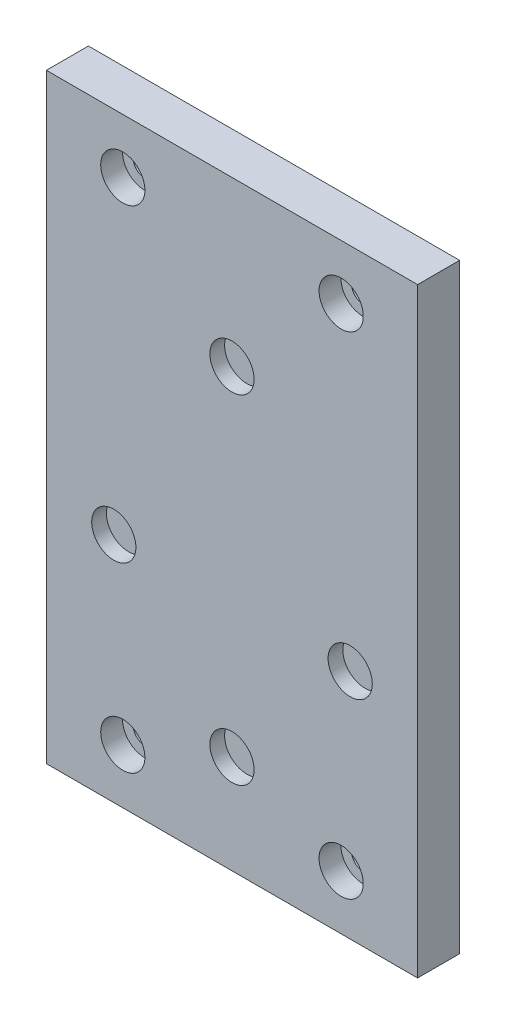
ISO-10303-21;
HEADER;
FILE_DESCRIPTION(('STEP AP214'),'2;1');
FILE_NAME('part.step','',(''),(''),'','','');
FILE_SCHEMA(('AUTOMOTIVE_DESIGN { 1 0 10303 214 1 1 1 1 }'));
ENDSEC;
DATA;
#1=APPLICATION_CONTEXT('core data for automotive mechanical design processes');
#2=APPLICATION_PROTOCOL_DEFINITION('international standard','automotive_design',2000,#1);
#3=PRODUCT_CONTEXT('',#1,'mechanical');
#4=PRODUCT('Part','Part','',(#3));
#5=PRODUCT_RELATED_PRODUCT_CATEGORY('part','',(#4));
#6=PRODUCT_DEFINITION_FORMATION('','',#4);
#7=PRODUCT_DEFINITION_CONTEXT('part definition',#1,'design');
#8=PRODUCT_DEFINITION('design','',#6,#7);
#9=PRODUCT_DEFINITION_SHAPE('','',#8);
#10=(LENGTH_UNIT() NAMED_UNIT(*) SI_UNIT(.MILLI.,.METRE.));
#11=(NAMED_UNIT(*) PLANE_ANGLE_UNIT() SI_UNIT($,.RADIAN.));
#12=(NAMED_UNIT(*) SI_UNIT($,.STERADIAN.) SOLID_ANGLE_UNIT());
#13=UNCERTAINTY_MEASURE_WITH_UNIT(LENGTH_MEASURE(1.E-05),#10,'distance_accuracy_value','');
#14=(GEOMETRIC_REPRESENTATION_CONTEXT(3) GLOBAL_UNCERTAINTY_ASSIGNED_CONTEXT((#13)) GLOBAL_UNIT_ASSIGNED_CONTEXT((#10,
#11,#12)) REPRESENTATION_CONTEXT('',''));
#15=CARTESIAN_POINT('',(0.,0.,0.));
#16=DIRECTION('',(0.,0.,1.));
#17=DIRECTION('',(1.,0.,0.));
#18=AXIS2_PLACEMENT_3D('',#15,#16,#17);
#19=CARTESIAN_POINT('',(0.,-36.95,7.7));
#20=DIRECTION('',(0.,0.,-1.));
#21=DIRECTION('',(-1.,0.,0.));
#22=AXIS2_PLACEMENT_3D('',#19,#20,#21);
#23=CYLINDRICAL_SURFACE('',#22,4.05);
#24=CARTESIAN_POINT('',(0.,-36.95,7.7));
#25=DIRECTION('',(0.,0.,1.));
#26=DIRECTION('',(1.,0.,0.));
#27=AXIS2_PLACEMENT_3D('',#24,#25,#26);
#28=CIRCLE('',#27,4.05);
#29=CARTESIAN_POINT('',(4.05,-36.95,7.7));
#30=VERTEX_POINT('',#29);
#31=EDGE_CURVE('E113',#30,#30,#28,.T.);
#32=ORIENTED_EDGE('',*,*,#31,.T.);
#33=EDGE_LOOP('',(#32));
#34=FACE_BOUND('',#33,.T.);
#35=CARTESIAN_POINT('',(0.,-36.95,5.));
#36=DIRECTION('',(0.,0.,-1.));
#37=DIRECTION('',(-1.,0.,0.));
#38=AXIS2_PLACEMENT_3D('',#35,#36,#37);
#39=CIRCLE('',#38,4.05);
#40=CARTESIAN_POINT('',(-4.05,-36.95,5.));
#41=VERTEX_POINT('',#40);
#42=EDGE_CURVE('E120',#41,#41,#39,.T.);
#43=ORIENTED_EDGE('',*,*,#42,.T.);
#44=EDGE_LOOP('',(#43));
#45=FACE_BOUND('',#44,.T.);
#46=ADVANCED_FACE('F33',(#34,#45),#23,.F.);
#47=CARTESIAN_POINT('',(-21.650635094611,-12.5,7.7));
#48=DIRECTION('',(0.,0.,-1.));
#49=DIRECTION('',(-1.,0.,0.));
#50=AXIS2_PLACEMENT_3D('',#47,#48,#49);
#51=CYLINDRICAL_SURFACE('',#50,4.05);
#52=CARTESIAN_POINT('',(-21.650635094611,-12.5,7.7));
#53=DIRECTION('',(0.,0.,1.));
#54=DIRECTION('',(1.,0.,0.));
#55=AXIS2_PLACEMENT_3D('',#52,#53,#54);
#56=CIRCLE('',#55,4.05);
#57=CARTESIAN_POINT('',(-17.600635094611,-12.5,7.7));
#58=VERTEX_POINT('',#57);
#59=EDGE_CURVE('E165',#58,#58,#56,.T.);
#60=ORIENTED_EDGE('',*,*,#59,.T.);
#61=EDGE_LOOP('',(#60));
#62=FACE_BOUND('',#61,.T.);
#63=CARTESIAN_POINT('',(-21.650635094611,-12.5,5.));
#64=DIRECTION('',(0.,0.,-1.));
#65=DIRECTION('',(-1.,0.,0.));
#66=AXIS2_PLACEMENT_3D('',#63,#64,#65);
#67=CIRCLE('',#66,4.05);
#68=CARTESIAN_POINT('',(-25.700635094611,-12.5,5.));
#69=VERTEX_POINT('',#68);
#70=EDGE_CURVE('E117',#69,#69,#67,.T.);
#71=ORIENTED_EDGE('',*,*,#70,.T.);
#72=EDGE_LOOP('',(#71));
#73=FACE_BOUND('',#72,.T.);
#74=ADVANCED_FACE('F212',(#62,#73),#51,.F.);
#75=CARTESIAN_POINT('',(0.,25.,7.7));
#76=DIRECTION('',(0.,0.,-1.));
#77=DIRECTION('',(-1.,0.,0.));
#78=AXIS2_PLACEMENT_3D('',#75,#76,#77);
#79=CYLINDRICAL_SURFACE('',#78,4.05);
#80=CARTESIAN_POINT('',(0.,25.,7.7));
#81=DIRECTION('',(0.,0.,1.));
#82=DIRECTION('',(1.,0.,0.));
#83=AXIS2_PLACEMENT_3D('',#80,#81,#82);
#84=CIRCLE('',#83,4.05);
#85=CARTESIAN_POINT('',(4.04999999999999,25.,7.7));
#86=VERTEX_POINT('',#85);
#87=EDGE_CURVE('E162',#86,#86,#84,.T.);
#88=ORIENTED_EDGE('',*,*,#87,.T.);
#89=EDGE_LOOP('',(#88));
#90=FACE_BOUND('',#89,.T.);
#91=CARTESIAN_POINT('',(0.,25.,5.));
#92=DIRECTION('',(0.,0.,-1.));
#93=DIRECTION('',(-1.,0.,0.));
#94=AXIS2_PLACEMENT_3D('',#91,#92,#93);
#95=CIRCLE('',#94,4.05);
#96=CARTESIAN_POINT('',(-4.05000000000001,25.,5.));
#97=VERTEX_POINT('',#96);
#98=EDGE_CURVE('E114',#97,#97,#95,.T.);
#99=ORIENTED_EDGE('',*,*,#98,.T.);
#100=EDGE_LOOP('',(#99));
#101=FACE_BOUND('',#100,.T.);
#102=ADVANCED_FACE('F218',(#90,#101),#79,.F.);
#103=CARTESIAN_POINT('',(21.650635094611,-12.5,7.7));
#104=DIRECTION('',(0.,0.,-1.));
#105=DIRECTION('',(-1.,0.,0.));
#106=AXIS2_PLACEMENT_3D('',#103,#104,#105);
#107=CYLINDRICAL_SURFACE('',#106,4.05);
#108=CARTESIAN_POINT('',(21.650635094611,-12.5,7.7));
#109=DIRECTION('',(0.,0.,1.));
#110=DIRECTION('',(1.,0.,0.));
#111=AXIS2_PLACEMENT_3D('',#108,#109,#110);
#112=CIRCLE('',#111,4.05);
#113=CARTESIAN_POINT('',(25.700635094611,-12.5,7.7));
#114=VERTEX_POINT('',#113);
#115=EDGE_CURVE('E159',#114,#114,#112,.T.);
#116=ORIENTED_EDGE('',*,*,#115,.T.);
#117=EDGE_LOOP('',(#116));
#118=FACE_BOUND('',#117,.T.);
#119=CARTESIAN_POINT('',(21.650635094611,-12.5,5.));
#120=DIRECTION('',(0.,0.,-1.));
#121=DIRECTION('',(-1.,0.,0.));
#122=AXIS2_PLACEMENT_3D('',#119,#120,#121);
#123=CIRCLE('',#122,4.05);
#124=CARTESIAN_POINT('',(17.600635094611,-12.5,5.));
#125=VERTEX_POINT('',#124);
#126=EDGE_CURVE('E110',#125,#125,#123,.T.);
#127=ORIENTED_EDGE('',*,*,#126,.T.);
#128=EDGE_LOOP('',(#127));
#129=FACE_BOUND('',#128,.T.);
#130=ADVANCED_FACE('F228',(#118,#129),#107,.F.);
#131=CARTESIAN_POINT('',(0.,0.,7.7));
#132=DIRECTION('',(0.,0.,1.));
#133=DIRECTION('',(1.,0.,0.));
#134=AXIS2_PLACEMENT_3D('',#131,#132,#133);
#135=PLANE('',#134);
#136=CARTESIAN_POINT('',(-20.,45.,7.7));
#137=DIRECTION('',(0.,0.,-1.));
#138=DIRECTION('',(-1.,0.,0.));
#139=AXIS2_PLACEMENT_3D('',#136,#137,#138);
#140=CIRCLE('',#139,4.05);
#141=CARTESIAN_POINT('',(-24.05,45.,7.7));
#142=VERTEX_POINT('',#141);
#143=EDGE_CURVE('E183',#142,#142,#140,.T.);
#144=ORIENTED_EDGE('',*,*,#143,.T.);
#145=EDGE_LOOP('',(#144));
#146=FACE_BOUND('',#145,.T.);
#147=CARTESIAN_POINT('',(20.,-45.,7.7));
#148=DIRECTION('',(0.,0.,-1.));
#149=DIRECTION('',(-1.,0.,0.));
#150=AXIS2_PLACEMENT_3D('',#147,#148,#149);
#151=CIRCLE('',#150,4.05);
#152=CARTESIAN_POINT('',(15.95,-45.,7.7));
#153=VERTEX_POINT('',#152);
#154=EDGE_CURVE('E176',#153,#153,#151,.T.);
#155=ORIENTED_EDGE('',*,*,#154,.T.);
#156=EDGE_LOOP('',(#155));
#157=FACE_BOUND('',#156,.T.);
#158=CARTESIAN_POINT('',(-20.,-45.,7.7));
#159=DIRECTION('',(0.,0.,-1.));
#160=DIRECTION('',(-1.,0.,0.));
#161=AXIS2_PLACEMENT_3D('',#158,#159,#160);
#162=CIRCLE('',#161,4.05);
#163=CARTESIAN_POINT('',(-24.05,-45.,7.7));
#164=VERTEX_POINT('',#163);
#165=EDGE_CURVE('E188',#164,#164,#162,.T.);
#166=ORIENTED_EDGE('',*,*,#165,.T.);
#167=EDGE_LOOP('',(#166));
#168=FACE_BOUND('',#167,.T.);
#169=CARTESIAN_POINT('',(20.,45.,7.7));
#170=DIRECTION('',(0.,0.,-1.));
#171=DIRECTION('',(-1.,0.,0.));
#172=AXIS2_PLACEMENT_3D('',#169,#170,#171);
#173=CIRCLE('',#172,4.05);
#174=CARTESIAN_POINT('',(15.95,45.,7.7));
#175=VERTEX_POINT('',#174);
#176=EDGE_CURVE('E170',#175,#175,#173,.T.);
#177=ORIENTED_EDGE('',*,*,#176,.T.);
#178=EDGE_LOOP('',(#177));
#179=FACE_BOUND('',#178,.T.);
#180=ORIENTED_EDGE('',*,*,#59,.F.);
#181=EDGE_LOOP('',(#180));
#182=FACE_BOUND('',#181,.T.);
#183=ORIENTED_EDGE('',*,*,#115,.F.);
#184=EDGE_LOOP('',(#183));
#185=FACE_BOUND('',#184,.T.);
#186=DIRECTION('',(0.,1.,0.));
#187=VECTOR('',#186,1.);
#188=CARTESIAN_POINT('',(34.,55.,7.7));
#189=LINE('',#188,#187);
#190=CARTESIAN_POINT('',(34.,-55.,7.7));
#191=VERTEX_POINT('',#190);
#192=CARTESIAN_POINT('',(34.,55.,7.7));
#193=VERTEX_POINT('',#192);
#194=EDGE_CURVE('E88',#191,#193,#189,.T.);
#195=ORIENTED_EDGE('',*,*,#194,.T.);
#196=DIRECTION('',(-1.,0.,0.));
#197=VECTOR('',#196,1.);
#198=CARTESIAN_POINT('',(-34.,55.,7.7));
#199=LINE('',#198,#197);
#200=CARTESIAN_POINT('',(-34.,55.,7.7));
#201=VERTEX_POINT('',#200);
#202=EDGE_CURVE('E82',#193,#201,#199,.T.);
#203=ORIENTED_EDGE('',*,*,#202,.T.);
#204=DIRECTION('',(0.,-1.,0.));
#205=VECTOR('',#204,1.);
#206=CARTESIAN_POINT('',(-34.,55.,7.7));
#207=LINE('',#206,#205);
#208=CARTESIAN_POINT('',(-34.,-55.,7.7));
#209=VERTEX_POINT('',#208);
#210=EDGE_CURVE('E86',#201,#209,#207,.T.);
#211=ORIENTED_EDGE('',*,*,#210,.T.);
#212=DIRECTION('',(1.,0.,0.));
#213=VECTOR('',#212,1.);
#214=CARTESIAN_POINT('',(-34.,-55.,7.7));
#215=LINE('',#214,#213);
#216=EDGE_CURVE('E52',#209,#191,#215,.T.);
#217=ORIENTED_EDGE('',*,*,#216,.T.);
#218=EDGE_LOOP('',(#195,#203,#211,#217));
#219=FACE_BOUND('',#218,.T.);
#220=ORIENTED_EDGE('',*,*,#87,.F.);
#221=EDGE_LOOP('',(#220));
#222=FACE_BOUND('',#221,.T.);
#223=ORIENTED_EDGE('',*,*,#31,.F.);
#224=EDGE_LOOP('',(#223));
#225=FACE_BOUND('',#224,.T.);
#226=ADVANCED_FACE('F83',(#146,#157,#168,#179,#182,#185,#219,#222,#225),#135,.T.);
#227=CARTESIAN_POINT('',(0.,0.,0.));
#228=DIRECTION('',(0.,0.,1.));
#229=DIRECTION('',(1.,0.,0.));
#230=AXIS2_PLACEMENT_3D('',#227,#228,#229);
#231=PLANE('',#230);
#232=DIRECTION('',(0.,1.,0.));
#233=VECTOR('',#232,1.);
#234=CARTESIAN_POINT('',(34.,55.,0.));
#235=LINE('',#234,#233);
#236=CARTESIAN_POINT('',(34.,-55.,0.));
#237=VERTEX_POINT('',#236);
#238=CARTESIAN_POINT('',(34.,55.,0.));
#239=VERTEX_POINT('',#238);
#240=EDGE_CURVE('E101',#237,#239,#235,.T.);
#241=ORIENTED_EDGE('',*,*,#240,.F.);
#242=DIRECTION('',(1.,0.,0.));
#243=VECTOR('',#242,1.);
#244=CARTESIAN_POINT('',(-34.,-55.,0.));
#245=LINE('',#244,#243);
#246=CARTESIAN_POINT('',(-34.,-55.,0.));
#247=VERTEX_POINT('',#246);
#248=EDGE_CURVE('E75',#247,#237,#245,.T.);
#249=ORIENTED_EDGE('',*,*,#248,.F.);
#250=DIRECTION('',(0.,-1.,0.));
#251=VECTOR('',#250,1.);
#252=CARTESIAN_POINT('',(-34.,55.,0.));
#253=LINE('',#252,#251);
#254=CARTESIAN_POINT('',(-34.,55.,0.));
#255=VERTEX_POINT('',#254);
#256=EDGE_CURVE('E69',#255,#247,#253,.T.);
#257=ORIENTED_EDGE('',*,*,#256,.F.);
#258=DIRECTION('',(-1.,0.,0.));
#259=VECTOR('',#258,1.);
#260=CARTESIAN_POINT('',(-34.,55.,0.));
#261=LINE('',#260,#259);
#262=EDGE_CURVE('E92',#239,#255,#261,.T.);
#263=ORIENTED_EDGE('',*,*,#262,.F.);
#264=EDGE_LOOP('',(#241,#249,#257,#263));
#265=FACE_BOUND('',#264,.T.);
#266=CARTESIAN_POINT('',(20.,45.,0.));
#267=DIRECTION('',(0.,0.,1.));
#268=DIRECTION('',(1.,0.,0.));
#269=AXIS2_PLACEMENT_3D('',#266,#267,#268);
#270=CIRCLE('',#269,2.1);
#271=CARTESIAN_POINT('',(22.1,45.,0.));
#272=VERTEX_POINT('',#271);
#273=EDGE_CURVE('E104',#272,#272,#270,.T.);
#274=ORIENTED_EDGE('',*,*,#273,.T.);
#275=EDGE_LOOP('',(#274));
#276=FACE_BOUND('',#275,.T.);
#277=CARTESIAN_POINT('',(-20.,45.,0.));
#278=DIRECTION('',(0.,0.,1.));
#279=DIRECTION('',(1.,0.,0.));
#280=AXIS2_PLACEMENT_3D('',#277,#278,#279);
#281=CIRCLE('',#280,2.1);
#282=CARTESIAN_POINT('',(-17.9,45.,0.));
#283=VERTEX_POINT('',#282);
#284=EDGE_CURVE('E148',#283,#283,#281,.T.);
#285=ORIENTED_EDGE('',*,*,#284,.T.);
#286=EDGE_LOOP('',(#285));
#287=FACE_BOUND('',#286,.T.);
#288=CARTESIAN_POINT('',(20.,-45.,0.));
#289=DIRECTION('',(0.,0.,1.));
#290=DIRECTION('',(1.,0.,0.));
#291=AXIS2_PLACEMENT_3D('',#288,#289,#290);
#292=CIRCLE('',#291,2.1);
#293=CARTESIAN_POINT('',(22.1,-45.,0.));
#294=VERTEX_POINT('',#293);
#295=EDGE_CURVE('E151',#294,#294,#292,.T.);
#296=ORIENTED_EDGE('',*,*,#295,.T.);
#297=EDGE_LOOP('',(#296));
#298=FACE_BOUND('',#297,.T.);
#299=CARTESIAN_POINT('',(-20.,-45.,0.));
#300=DIRECTION('',(0.,0.,1.));
#301=DIRECTION('',(1.,0.,0.));
#302=AXIS2_PLACEMENT_3D('',#299,#300,#301);
#303=CIRCLE('',#302,2.1);
#304=CARTESIAN_POINT('',(-17.9,-45.,0.));
#305=VERTEX_POINT('',#304);
#306=EDGE_CURVE('E156',#305,#305,#303,.T.);
#307=ORIENTED_EDGE('',*,*,#306,.T.);
#308=EDGE_LOOP('',(#307));
#309=FACE_BOUND('',#308,.T.);
#310=ADVANCED_FACE('F246',(#265,#276,#287,#298,#309),#231,.F.);
#311=CARTESIAN_POINT('',(34.,55.,7.7));
#312=DIRECTION('',(-1.,0.,0.));
#313=DIRECTION('',(0.,-1.,0.));
#314=AXIS2_PLACEMENT_3D('',#311,#312,#313);
#315=PLANE('',#314);
#316=ORIENTED_EDGE('',*,*,#240,.T.);
#317=DIRECTION('',(0.,0.,-1.));
#318=VECTOR('',#317,1.);
#319=CARTESIAN_POINT('',(34.,55.,7.7));
#320=LINE('',#319,#318);
#321=EDGE_CURVE('E11',#193,#239,#320,.T.);
#322=ORIENTED_EDGE('',*,*,#321,.F.);
#323=ORIENTED_EDGE('',*,*,#194,.F.);
#324=DIRECTION('',(0.,0.,-1.));
#325=VECTOR('',#324,1.);
#326=CARTESIAN_POINT('',(34.,-55.,7.7));
#327=LINE('',#326,#325);
#328=EDGE_CURVE('E97',#191,#237,#327,.T.);
#329=ORIENTED_EDGE('',*,*,#328,.T.);
#330=EDGE_LOOP('',(#316,#322,#323,#329));
#331=FACE_BOUND('',#330,.T.);
#332=ADVANCED_FACE('F35',(#331),#315,.F.);
#333=CARTESIAN_POINT('',(-34.,55.,7.7));
#334=DIRECTION('',(0.,-1.,0.));
#335=DIRECTION('',(0.,0.,-1.));
#336=AXIS2_PLACEMENT_3D('',#333,#334,#335);
#337=PLANE('',#336);
#338=ORIENTED_EDGE('',*,*,#262,.T.);
#339=DIRECTION('',(0.,0.,-1.));
#340=VECTOR('',#339,1.);
#341=CARTESIAN_POINT('',(-34.,55.,7.7));
#342=LINE('',#341,#340);
#343=EDGE_CURVE('E43',#201,#255,#342,.T.);
#344=ORIENTED_EDGE('',*,*,#343,.F.);
#345=ORIENTED_EDGE('',*,*,#202,.F.);
#346=ORIENTED_EDGE('',*,*,#321,.T.);
#347=EDGE_LOOP('',(#338,#344,#345,#346));
#348=FACE_BOUND('',#347,.T.);
#349=ADVANCED_FACE('F91',(#348),#337,.F.);
#350=CARTESIAN_POINT('',(-34.,55.,7.7));
#351=DIRECTION('',(1.,0.,0.));
#352=DIRECTION('',(0.,1.,0.));
#353=AXIS2_PLACEMENT_3D('',#350,#351,#352);
#354=PLANE('',#353);
#355=ORIENTED_EDGE('',*,*,#256,.T.);
#356=DIRECTION('',(0.,0.,-1.));
#357=VECTOR('',#356,1.);
#358=CARTESIAN_POINT('',(-34.,-55.,7.7));
#359=LINE('',#358,#357);
#360=EDGE_CURVE('E93',#209,#247,#359,.T.);
#361=ORIENTED_EDGE('',*,*,#360,.F.);
#362=ORIENTED_EDGE('',*,*,#210,.F.);
#363=ORIENTED_EDGE('',*,*,#343,.T.);
#364=EDGE_LOOP('',(#355,#361,#362,#363));
#365=FACE_BOUND('',#364,.T.);
#366=ADVANCED_FACE('F95',(#365),#354,.F.);
#367=CARTESIAN_POINT('',(-34.,-55.,7.7));
#368=DIRECTION('',(0.,1.,0.));
#369=DIRECTION('',(0.,0.,1.));
#370=AXIS2_PLACEMENT_3D('',#367,#368,#369);
#371=PLANE('',#370);
#372=ORIENTED_EDGE('',*,*,#248,.T.);
#373=ORIENTED_EDGE('',*,*,#328,.F.);
#374=ORIENTED_EDGE('',*,*,#216,.F.);
#375=ORIENTED_EDGE('',*,*,#360,.T.);
#376=EDGE_LOOP('',(#372,#373,#374,#375));
#377=FACE_BOUND('',#376,.T.);
#378=ADVANCED_FACE('F143',(#377),#371,.F.);
#379=CARTESIAN_POINT('',(20.,45.,7.7));
#380=DIRECTION('',(0.,0.,-1.));
#381=DIRECTION('',(-1.,0.,0.));
#382=AXIS2_PLACEMENT_3D('',#379,#380,#381);
#383=CYLINDRICAL_SURFACE('',#382,2.1);
#384=CARTESIAN_POINT('',(20.,45.,3.7));
#385=DIRECTION('',(0.,0.,-1.));
#386=DIRECTION('',(-1.,0.,0.));
#387=AXIS2_PLACEMENT_3D('',#384,#385,#386);
#388=CIRCLE('',#387,2.1);
#389=CARTESIAN_POINT('',(17.9,45.,3.7));
#390=VERTEX_POINT('',#389);
#391=EDGE_CURVE('E37',#390,#390,#388,.T.);
#392=ORIENTED_EDGE('',*,*,#391,.F.);
#393=EDGE_LOOP('',(#392));
#394=FACE_BOUND('',#393,.T.);
#395=ORIENTED_EDGE('',*,*,#273,.F.);
#396=EDGE_LOOP('',(#395));
#397=FACE_BOUND('',#396,.T.);
#398=ADVANCED_FACE('F139',(#394,#397),#383,.F.);
#399=CARTESIAN_POINT('',(-20.,45.,7.7));
#400=DIRECTION('',(0.,0.,-1.));
#401=DIRECTION('',(-1.,0.,0.));
#402=AXIS2_PLACEMENT_3D('',#399,#400,#401);
#403=CYLINDRICAL_SURFACE('',#402,2.1);
#404=CARTESIAN_POINT('',(-20.,45.,3.7));
#405=DIRECTION('',(0.,0.,-1.));
#406=DIRECTION('',(-1.,0.,0.));
#407=AXIS2_PLACEMENT_3D('',#404,#405,#406);
#408=CIRCLE('',#407,2.1);
#409=CARTESIAN_POINT('',(-22.1,45.,3.7));
#410=VERTEX_POINT('',#409);
#411=EDGE_CURVE('E129',#410,#410,#408,.T.);
#412=ORIENTED_EDGE('',*,*,#411,.F.);
#413=EDGE_LOOP('',(#412));
#414=FACE_BOUND('',#413,.T.);
#415=ORIENTED_EDGE('',*,*,#284,.F.);
#416=EDGE_LOOP('',(#415));
#417=FACE_BOUND('',#416,.T.);
#418=ADVANCED_FACE('F142',(#414,#417),#403,.F.);
#419=CARTESIAN_POINT('',(20.,-45.,7.7));
#420=DIRECTION('',(0.,0.,-1.));
#421=DIRECTION('',(-1.,0.,0.));
#422=AXIS2_PLACEMENT_3D('',#419,#420,#421);
#423=CYLINDRICAL_SURFACE('',#422,2.1);
#424=CARTESIAN_POINT('',(20.,-45.,3.7));
#425=DIRECTION('',(0.,0.,-1.));
#426=DIRECTION('',(-1.,0.,0.));
#427=AXIS2_PLACEMENT_3D('',#424,#425,#426);
#428=CIRCLE('',#427,2.1);
#429=CARTESIAN_POINT('',(17.9,-45.,3.7));
#430=VERTEX_POINT('',#429);
#431=EDGE_CURVE('E126',#430,#430,#428,.T.);
#432=ORIENTED_EDGE('',*,*,#431,.F.);
#433=EDGE_LOOP('',(#432));
#434=FACE_BOUND('',#433,.T.);
#435=ORIENTED_EDGE('',*,*,#295,.F.);
#436=EDGE_LOOP('',(#435));
#437=FACE_BOUND('',#436,.T.);
#438=ADVANCED_FACE('F236',(#434,#437),#423,.F.);
#439=CARTESIAN_POINT('',(-20.,-45.,7.7));
#440=DIRECTION('',(0.,0.,-1.));
#441=DIRECTION('',(-1.,0.,0.));
#442=AXIS2_PLACEMENT_3D('',#439,#440,#441);
#443=CYLINDRICAL_SURFACE('',#442,2.1);
#444=CARTESIAN_POINT('',(-20.,-45.,3.7));
#445=DIRECTION('',(0.,0.,-1.));
#446=DIRECTION('',(-1.,0.,0.));
#447=AXIS2_PLACEMENT_3D('',#444,#445,#446);
#448=CIRCLE('',#447,2.1);
#449=CARTESIAN_POINT('',(-22.1,-45.,3.7));
#450=VERTEX_POINT('',#449);
#451=EDGE_CURVE('E123',#450,#450,#448,.T.);
#452=ORIENTED_EDGE('',*,*,#451,.F.);
#453=EDGE_LOOP('',(#452));
#454=FACE_BOUND('',#453,.T.);
#455=ORIENTED_EDGE('',*,*,#306,.F.);
#456=EDGE_LOOP('',(#455));
#457=FACE_BOUND('',#456,.T.);
#458=ADVANCED_FACE('F233',(#454,#457),#443,.F.);
#459=CARTESIAN_POINT('',(21.650635094611,-12.5,5.));
#460=DIRECTION('',(0.,0.,-1.));
#461=DIRECTION('',(-1.,0.,0.));
#462=AXIS2_PLACEMENT_3D('',#459,#460,#461);
#463=PLANE('',#462);
#464=ORIENTED_EDGE('',*,*,#126,.F.);
#465=EDGE_LOOP('',(#464));
#466=FACE_BOUND('',#465,.T.);
#467=ADVANCED_FACE('F223',(#466),#463,.F.);
#468=CARTESIAN_POINT('',(0.,25.,5.));
#469=DIRECTION('',(0.,0.,-1.));
#470=DIRECTION('',(-1.,0.,0.));
#471=AXIS2_PLACEMENT_3D('',#468,#469,#470);
#472=PLANE('',#471);
#473=ORIENTED_EDGE('',*,*,#98,.F.);
#474=EDGE_LOOP('',(#473));
#475=FACE_BOUND('',#474,.T.);
#476=ADVANCED_FACE('F342',(#475),#472,.F.);
#477=CARTESIAN_POINT('',(-21.650635094611,-12.5,5.));
#478=DIRECTION('',(0.,0.,-1.));
#479=DIRECTION('',(-1.,0.,0.));
#480=AXIS2_PLACEMENT_3D('',#477,#478,#479);
#481=PLANE('',#480);
#482=ORIENTED_EDGE('',*,*,#70,.F.);
#483=EDGE_LOOP('',(#482));
#484=FACE_BOUND('',#483,.T.);
#485=ADVANCED_FACE('F350',(#484),#481,.F.);
#486=CARTESIAN_POINT('',(0.,-36.95,5.));
#487=DIRECTION('',(0.,0.,-1.));
#488=DIRECTION('',(-1.,0.,0.));
#489=AXIS2_PLACEMENT_3D('',#486,#487,#488);
#490=PLANE('',#489);
#491=ORIENTED_EDGE('',*,*,#42,.F.);
#492=EDGE_LOOP('',(#491));
#493=FACE_BOUND('',#492,.T.);
#494=ADVANCED_FACE('F209',(#493),#490,.F.);
#495=CARTESIAN_POINT('',(-20.,-45.,3.7));
#496=DIRECTION('',(0.,0.,1.));
#497=DIRECTION('',(1.,0.,0.));
#498=AXIS2_PLACEMENT_3D('',#495,#496,#497);
#499=CYLINDRICAL_SURFACE('',#498,4.05);
#500=CARTESIAN_POINT('',(-20.,-45.,3.7));
#501=DIRECTION('',(0.,0.,-1.));
#502=DIRECTION('',(-1.,0.,0.));
#503=AXIS2_PLACEMENT_3D('',#500,#501,#502);
#504=CIRCLE('',#503,4.05);
#505=CARTESIAN_POINT('',(-24.05,-45.,3.7));
#506=VERTEX_POINT('',#505);
#507=EDGE_CURVE('E180',#506,#506,#504,.T.);
#508=ORIENTED_EDGE('',*,*,#507,.T.);
#509=EDGE_LOOP('',(#508));
#510=FACE_BOUND('',#509,.T.);
#511=ORIENTED_EDGE('',*,*,#165,.F.);
#512=EDGE_LOOP('',(#511));
#513=FACE_BOUND('',#512,.T.);
#514=ADVANCED_FACE('F194',(#510,#513),#499,.F.);
#515=CARTESIAN_POINT('',(-20.,-45.,3.7));
#516=DIRECTION('',(0.,0.,-1.));
#517=DIRECTION('',(-1.,0.,0.));
#518=AXIS2_PLACEMENT_3D('',#515,#516,#517);
#519=PLANE('',#518);
#520=ORIENTED_EDGE('',*,*,#451,.T.);
#521=EDGE_LOOP('',(#520));
#522=FACE_BOUND('',#521,.T.);
#523=ORIENTED_EDGE('',*,*,#507,.F.);
#524=EDGE_LOOP('',(#523));
#525=FACE_BOUND('',#524,.T.);
#526=ADVANCED_FACE('F197',(#522,#525),#519,.F.);
#527=CARTESIAN_POINT('',(20.,-45.,3.7));
#528=DIRECTION('',(0.,0.,1.));
#529=DIRECTION('',(1.,0.,0.));
#530=AXIS2_PLACEMENT_3D('',#527,#528,#529);
#531=CYLINDRICAL_SURFACE('',#530,4.05);
#532=CARTESIAN_POINT('',(20.,-45.,3.7));
#533=DIRECTION('',(0.,0.,-1.));
#534=DIRECTION('',(-1.,0.,0.));
#535=AXIS2_PLACEMENT_3D('',#532,#533,#534);
#536=CIRCLE('',#535,4.05);
#537=CARTESIAN_POINT('',(15.95,-45.,3.7));
#538=VERTEX_POINT('',#537);
#539=EDGE_CURVE('E179',#538,#538,#536,.T.);
#540=ORIENTED_EDGE('',*,*,#539,.T.);
#541=EDGE_LOOP('',(#540));
#542=FACE_BOUND('',#541,.T.);
#543=ORIENTED_EDGE('',*,*,#154,.F.);
#544=EDGE_LOOP('',(#543));
#545=FACE_BOUND('',#544,.T.);
#546=ADVANCED_FACE('F199',(#542,#545),#531,.F.);
#547=CARTESIAN_POINT('',(20.,-45.,3.7));
#548=DIRECTION('',(0.,0.,-1.));
#549=DIRECTION('',(-1.,0.,0.));
#550=AXIS2_PLACEMENT_3D('',#547,#548,#549);
#551=PLANE('',#550);
#552=ORIENTED_EDGE('',*,*,#431,.T.);
#553=EDGE_LOOP('',(#552));
#554=FACE_BOUND('',#553,.T.);
#555=ORIENTED_EDGE('',*,*,#539,.F.);
#556=EDGE_LOOP('',(#555));
#557=FACE_BOUND('',#556,.T.);
#558=ADVANCED_FACE('F206',(#554,#557),#551,.F.);
#559=CARTESIAN_POINT('',(-20.,45.,3.7));
#560=DIRECTION('',(0.,0.,1.));
#561=DIRECTION('',(1.,0.,0.));
#562=AXIS2_PLACEMENT_3D('',#559,#560,#561);
#563=CYLINDRICAL_SURFACE('',#562,4.05);
#564=CARTESIAN_POINT('',(-20.,45.,3.7));
#565=DIRECTION('',(0.,0.,-1.));
#566=DIRECTION('',(-1.,0.,0.));
#567=AXIS2_PLACEMENT_3D('',#564,#565,#566);
#568=CIRCLE('',#567,4.05);
#569=CARTESIAN_POINT('',(-24.05,45.,3.7));
#570=VERTEX_POINT('',#569);
#571=EDGE_CURVE('E173',#570,#570,#568,.T.);
#572=ORIENTED_EDGE('',*,*,#571,.T.);
#573=EDGE_LOOP('',(#572));
#574=FACE_BOUND('',#573,.T.);
#575=ORIENTED_EDGE('',*,*,#143,.F.);
#576=EDGE_LOOP('',(#575));
#577=FACE_BOUND('',#576,.T.);
#578=ADVANCED_FACE('F388',(#574,#577),#563,.F.);
#579=CARTESIAN_POINT('',(-20.,45.,3.7));
#580=DIRECTION('',(0.,0.,-1.));
#581=DIRECTION('',(-1.,0.,0.));
#582=AXIS2_PLACEMENT_3D('',#579,#580,#581);
#583=PLANE('',#582);
#584=ORIENTED_EDGE('',*,*,#411,.T.);
#585=EDGE_LOOP('',(#584));
#586=FACE_BOUND('',#585,.T.);
#587=ORIENTED_EDGE('',*,*,#571,.F.);
#588=EDGE_LOOP('',(#587));
#589=FACE_BOUND('',#588,.T.);
#590=ADVANCED_FACE('F397',(#586,#589),#583,.F.);
#591=CARTESIAN_POINT('',(20.,45.,3.7));
#592=DIRECTION('',(0.,0.,1.));
#593=DIRECTION('',(1.,0.,0.));
#594=AXIS2_PLACEMENT_3D('',#591,#592,#593);
#595=CYLINDRICAL_SURFACE('',#594,4.05);
#596=CARTESIAN_POINT('',(20.,45.,3.7));
#597=DIRECTION('',(0.,0.,-1.));
#598=DIRECTION('',(-1.,0.,0.));
#599=AXIS2_PLACEMENT_3D('',#596,#597,#598);
#600=CIRCLE('',#599,4.05);
#601=CARTESIAN_POINT('',(15.95,45.,3.7));
#602=VERTEX_POINT('',#601);
#603=EDGE_CURVE('E127',#602,#602,#600,.T.);
#604=ORIENTED_EDGE('',*,*,#603,.T.);
#605=EDGE_LOOP('',(#604));
#606=FACE_BOUND('',#605,.T.);
#607=ORIENTED_EDGE('',*,*,#176,.F.);
#608=EDGE_LOOP('',(#607));
#609=FACE_BOUND('',#608,.T.);
#610=ADVANCED_FACE('F406',(#606,#609),#595,.F.);
#611=CARTESIAN_POINT('',(20.,45.,3.7));
#612=DIRECTION('',(0.,0.,-1.));
#613=DIRECTION('',(-1.,0.,0.));
#614=AXIS2_PLACEMENT_3D('',#611,#612,#613);
#615=PLANE('',#614);
#616=ORIENTED_EDGE('',*,*,#391,.T.);
#617=EDGE_LOOP('',(#616));
#618=FACE_BOUND('',#617,.T.);
#619=ORIENTED_EDGE('',*,*,#603,.F.);
#620=EDGE_LOOP('',(#619));
#621=FACE_BOUND('',#620,.T.);
#622=ADVANCED_FACE('F136',(#618,#621),#615,.F.);
#623=CLOSED_SHELL('',(#46,#74,#102,#130,#226,#310,#332,#349,#366,#378,#398,#418,#438,#458,#467,
#476,#485,#494,#514,#526,#546,#558,#578,#590,#610,#622));
#624=MANIFOLD_SOLID_BREP('B2',#623);
#625=ADVANCED_BREP_SHAPE_REPRESENTATION('',(#18,#624),#14);
#626=SHAPE_DEFINITION_REPRESENTATION(#9,#625);
ENDSEC;
END-ISO-10303-21;
